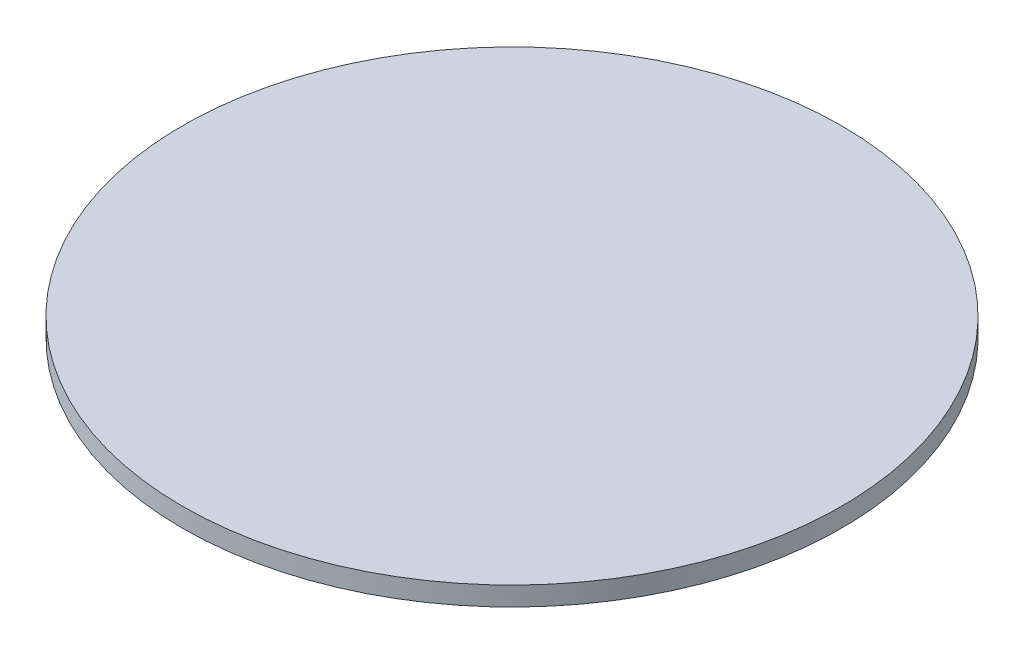
ISO-10303-21;
HEADER;
FILE_DESCRIPTION(('STEP AP214'),'2;1');
FILE_NAME('part.step','',(''),(''),'','','');
FILE_SCHEMA(('AUTOMOTIVE_DESIGN { 1 0 10303 214 1 1 1 1 }'));
ENDSEC;
DATA;
#1=APPLICATION_CONTEXT('core data for automotive mechanical design processes');
#2=APPLICATION_PROTOCOL_DEFINITION('international standard','automotive_design',2000,#1);
#3=PRODUCT_CONTEXT('',#1,'mechanical');
#4=PRODUCT('Part','Part','',(#3));
#5=PRODUCT_RELATED_PRODUCT_CATEGORY('part','',(#4));
#6=PRODUCT_DEFINITION_FORMATION('','',#4);
#7=PRODUCT_DEFINITION_CONTEXT('part definition',#1,'design');
#8=PRODUCT_DEFINITION('design','',#6,#7);
#9=PRODUCT_DEFINITION_SHAPE('','',#8);
#10=(LENGTH_UNIT() NAMED_UNIT(*) SI_UNIT(.MILLI.,.METRE.));
#11=(NAMED_UNIT(*) PLANE_ANGLE_UNIT() SI_UNIT($,.RADIAN.));
#12=(NAMED_UNIT(*) SI_UNIT($,.STERADIAN.) SOLID_ANGLE_UNIT());
#13=UNCERTAINTY_MEASURE_WITH_UNIT(LENGTH_MEASURE(1.E-05),#10,'distance_accuracy_value','');
#14=(GEOMETRIC_REPRESENTATION_CONTEXT(3) GLOBAL_UNCERTAINTY_ASSIGNED_CONTEXT((#13)) GLOBAL_UNIT_ASSIGNED_CONTEXT((#10,
#11,#12)) REPRESENTATION_CONTEXT('',''));
#15=CARTESIAN_POINT('',(0.,0.,0.));
#16=DIRECTION('',(0.,0.,1.));
#17=DIRECTION('',(1.,0.,0.));
#18=AXIS2_PLACEMENT_3D('',#15,#16,#17);
#19=CARTESIAN_POINT('',(0.,1.,0.));
#20=DIRECTION('',(0.,-1.,0.));
#21=DIRECTION('',(0.,0.,-1.));
#22=AXIS2_PLACEMENT_3D('',#19,#20,#21);
#23=CYLINDRICAL_SURFACE('',#22,17.3);
#24=CARTESIAN_POINT('',(0.,1.,0.));
#25=DIRECTION('',(0.,1.,0.));
#26=DIRECTION('',(0.,0.,1.));
#27=AXIS2_PLACEMENT_3D('',#24,#25,#26);
#28=CIRCLE('',#27,17.3);
#29=CARTESIAN_POINT('',(0.,1.,17.3));
#30=VERTEX_POINT('',#29);
#31=EDGE_CURVE('E10',#30,#30,#28,.T.);
#32=ORIENTED_EDGE('',*,*,#31,.F.);
#33=EDGE_LOOP('',(#32));
#34=FACE_BOUND('',#33,.T.);
#35=CARTESIAN_POINT('',(0.,0.,0.));
#36=DIRECTION('',(0.,1.,0.));
#37=DIRECTION('',(0.,0.,1.));
#38=AXIS2_PLACEMENT_3D('',#35,#36,#37);
#39=CIRCLE('',#38,17.3);
#40=CARTESIAN_POINT('',(0.,0.,17.3));
#41=VERTEX_POINT('',#40);
#42=EDGE_CURVE('E34',#41,#41,#39,.T.);
#43=ORIENTED_EDGE('',*,*,#42,.T.);
#44=EDGE_LOOP('',(#43));
#45=FACE_BOUND('',#44,.T.);
#46=ADVANCED_FACE('F31',(#34,#45),#23,.T.);
#47=CARTESIAN_POINT('',(0.,1.,0.));
#48=DIRECTION('',(0.,1.,0.));
#49=DIRECTION('',(0.,0.,1.));
#50=AXIS2_PLACEMENT_3D('',#47,#48,#49);
#51=PLANE('',#50);
#52=ORIENTED_EDGE('',*,*,#31,.T.);
#53=EDGE_LOOP('',(#52));
#54=FACE_BOUND('',#53,.T.);
#55=ADVANCED_FACE('F46',(#54),#51,.T.);
#56=CARTESIAN_POINT('',(0.,0.,0.));
#57=DIRECTION('',(0.,1.,0.));
#58=DIRECTION('',(0.,0.,1.));
#59=AXIS2_PLACEMENT_3D('',#56,#57,#58);
#60=PLANE('',#59);
#61=ORIENTED_EDGE('',*,*,#42,.F.);
#62=EDGE_LOOP('',(#61));
#63=FACE_BOUND('',#62,.T.);
#64=ADVANCED_FACE('F44',(#63),#60,.F.);
#65=CLOSED_SHELL('',(#46,#55,#64));
#66=MANIFOLD_SOLID_BREP('B2',#65);
#67=ADVANCED_BREP_SHAPE_REPRESENTATION('',(#18,#66),#14);
#68=SHAPE_DEFINITION_REPRESENTATION(#9,#67);
ENDSEC;
END-ISO-10303-21;
